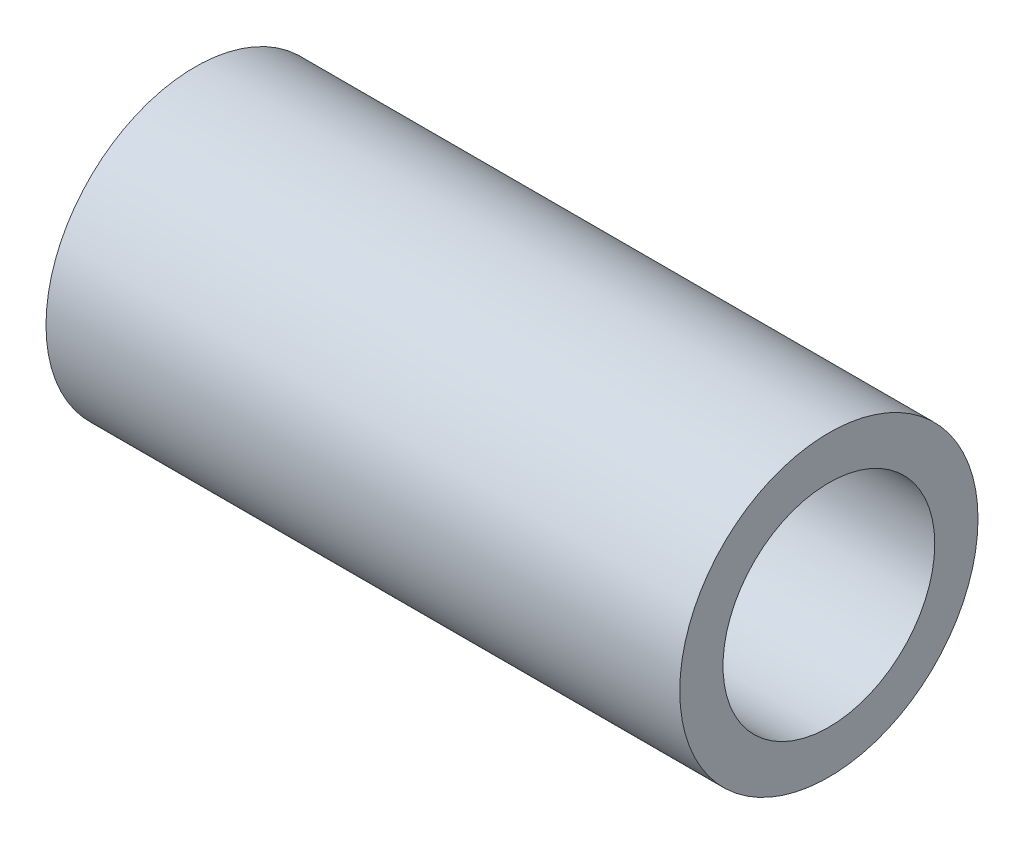
ISO-10303-21;
HEADER;
FILE_DESCRIPTION(('STEP AP214'),'2;1');
FILE_NAME('part.step','',(''),(''),'','','');
FILE_SCHEMA(('AUTOMOTIVE_DESIGN { 1 0 10303 214 1 1 1 1 }'));
ENDSEC;
DATA;
#1=APPLICATION_CONTEXT('core data for automotive mechanical design processes');
#2=APPLICATION_PROTOCOL_DEFINITION('international standard','automotive_design',2000,#1);
#3=PRODUCT_CONTEXT('',#1,'mechanical');
#4=PRODUCT('Part','Part','',(#3));
#5=PRODUCT_RELATED_PRODUCT_CATEGORY('part','',(#4));
#6=PRODUCT_DEFINITION_FORMATION('','',#4);
#7=PRODUCT_DEFINITION_CONTEXT('part definition',#1,'design');
#8=PRODUCT_DEFINITION('design','',#6,#7);
#9=PRODUCT_DEFINITION_SHAPE('','',#8);
#10=(LENGTH_UNIT() NAMED_UNIT(*) SI_UNIT(.MILLI.,.METRE.));
#11=(NAMED_UNIT(*) PLANE_ANGLE_UNIT() SI_UNIT($,.RADIAN.));
#12=(NAMED_UNIT(*) SI_UNIT($,.STERADIAN.) SOLID_ANGLE_UNIT());
#13=UNCERTAINTY_MEASURE_WITH_UNIT(LENGTH_MEASURE(1.E-05),#10,'distance_accuracy_value','');
#14=(GEOMETRIC_REPRESENTATION_CONTEXT(3) GLOBAL_UNCERTAINTY_ASSIGNED_CONTEXT((#13)) GLOBAL_UNIT_ASSIGNED_CONTEXT((#10,
#11,#12)) REPRESENTATION_CONTEXT('',''));
#15=CARTESIAN_POINT('',(0.,0.,0.));
#16=DIRECTION('',(0.,0.,1.));
#17=DIRECTION('',(1.,0.,0.));
#18=AXIS2_PLACEMENT_3D('',#15,#16,#17);
#19=CARTESIAN_POINT('',(0.,0.,0.));
#20=DIRECTION('',(1.,0.,0.));
#21=DIRECTION('',(0.,0.,-1.));
#22=AXIS2_PLACEMENT_3D('',#19,#20,#21);
#23=PLANE('',#22);
#24=CARTESIAN_POINT('',(0.,0.,0.));
#25=DIRECTION('',(1.,0.,0.));
#26=DIRECTION('',(0.,0.,-1.));
#27=AXIS2_PLACEMENT_3D('',#24,#25,#26);
#28=CIRCLE('',#27,12.7);
#29=CARTESIAN_POINT('',(0.,0.,-12.7));
#30=VERTEX_POINT('',#29);
#31=EDGE_CURVE('E11',#30,#30,#28,.T.);
#32=ORIENTED_EDGE('',*,*,#31,.F.);
#33=EDGE_LOOP('',(#32));
#34=FACE_BOUND('',#33,.T.);
#35=CARTESIAN_POINT('',(0.,0.,0.));
#36=DIRECTION('',(1.,0.,0.));
#37=DIRECTION('',(0.,0.,-1.));
#38=AXIS2_PLACEMENT_3D('',#35,#36,#37);
#39=CIRCLE('',#38,11.2141);
#40=CARTESIAN_POINT('',(0.,0.,-11.2141));
#41=VERTEX_POINT('',#40);
#42=EDGE_CURVE('E45',#41,#41,#39,.T.);
#43=ORIENTED_EDGE('',*,*,#42,.T.);
#44=EDGE_LOOP('',(#43));
#45=FACE_BOUND('',#44,.T.);
#46=ADVANCED_FACE('F38',(#34,#45),#23,.F.);
#47=CARTESIAN_POINT('',(28.575,0.,0.));
#48=DIRECTION('',(-1.,0.,0.));
#49=DIRECTION('',(0.,0.,1.));
#50=AXIS2_PLACEMENT_3D('',#47,#48,#49);
#51=CYLINDRICAL_SURFACE('',#50,12.7);
#52=ORIENTED_EDGE('',*,*,#31,.T.);
#53=EDGE_LOOP('',(#52));
#54=FACE_BOUND('',#53,.T.);
#55=CARTESIAN_POINT('',(53.975,0.,0.));
#56=DIRECTION('',(1.,0.,0.));
#57=DIRECTION('',(0.,0.,-1.));
#58=AXIS2_PLACEMENT_3D('',#55,#56,#57);
#59=CIRCLE('',#58,12.7);
#60=CARTESIAN_POINT('',(53.975,0.,-12.7));
#61=VERTEX_POINT('',#60);
#62=EDGE_CURVE('E49',#61,#61,#59,.T.);
#63=ORIENTED_EDGE('',*,*,#62,.F.);
#64=EDGE_LOOP('',(#63));
#65=FACE_BOUND('',#64,.T.);
#66=ADVANCED_FACE('F40',(#54,#65),#51,.T.);
#67=CARTESIAN_POINT('',(28.575,0.,0.));
#68=DIRECTION('',(-1.,0.,0.));
#69=DIRECTION('',(0.,0.,1.));
#70=AXIS2_PLACEMENT_3D('',#67,#68,#69);
#71=CYLINDRICAL_SURFACE('',#70,11.2141);
#72=ORIENTED_EDGE('',*,*,#42,.F.);
#73=EDGE_LOOP('',(#72));
#74=FACE_BOUND('',#73,.T.);
#75=CARTESIAN_POINT('',(31.75,0.,0.));
#76=DIRECTION('',(1.,0.,0.));
#77=DIRECTION('',(0.,0.,-1.));
#78=AXIS2_PLACEMENT_3D('',#75,#76,#77);
#79=CIRCLE('',#78,11.2141);
#80=CARTESIAN_POINT('',(31.75,0.,-11.2141));
#81=VERTEX_POINT('',#80);
#82=EDGE_CURVE('E61',#81,#81,#79,.F.);
#83=ORIENTED_EDGE('',*,*,#82,.F.);
#84=EDGE_LOOP('',(#83));
#85=FACE_BOUND('',#84,.T.);
#86=ADVANCED_FACE('F68',(#74,#85),#71,.F.);
#87=CARTESIAN_POINT('',(53.975,0.,0.));
#88=DIRECTION('',(1.,0.,0.));
#89=DIRECTION('',(0.,0.,-1.));
#90=AXIS2_PLACEMENT_3D('',#87,#88,#89);
#91=PLANE('',#90);
#92=ORIENTED_EDGE('',*,*,#62,.T.);
#93=EDGE_LOOP('',(#92));
#94=FACE_BOUND('',#93,.T.);
#95=CARTESIAN_POINT('',(53.975,0.,0.));
#96=DIRECTION('',(1.,0.,0.));
#97=DIRECTION('',(0.,0.,-1.));
#98=AXIS2_PLACEMENT_3D('',#95,#96,#97);
#99=CIRCLE('',#98,9.017);
#100=CARTESIAN_POINT('',(53.975,0.,-9.017));
#101=VERTEX_POINT('',#100);
#102=EDGE_CURVE('E53',#101,#101,#99,.T.);
#103=ORIENTED_EDGE('',*,*,#102,.F.);
#104=EDGE_LOOP('',(#103));
#105=FACE_BOUND('',#104,.T.);
#106=ADVANCED_FACE('F70',(#94,#105),#91,.T.);
#107=CARTESIAN_POINT('',(53.975,0.,0.));
#108=DIRECTION('',(-1.,0.,0.));
#109=DIRECTION('',(0.,0.,1.));
#110=AXIS2_PLACEMENT_3D('',#107,#108,#109);
#111=CYLINDRICAL_SURFACE('',#110,9.017);
#112=CARTESIAN_POINT('',(31.75,0.,0.));
#113=DIRECTION('',(1.,0.,0.));
#114=DIRECTION('',(0.,0.,-1.));
#115=AXIS2_PLACEMENT_3D('',#112,#113,#114);
#116=CIRCLE('',#115,9.017);
#117=CARTESIAN_POINT('',(31.75,0.,-9.017));
#118=VERTEX_POINT('',#117);
#119=EDGE_CURVE('E58',#118,#118,#116,.F.);
#120=ORIENTED_EDGE('',*,*,#119,.T.);
#121=EDGE_LOOP('',(#120));
#122=FACE_BOUND('',#121,.T.);
#123=ORIENTED_EDGE('',*,*,#102,.T.);
#124=EDGE_LOOP('',(#123));
#125=FACE_BOUND('',#124,.T.);
#126=ADVANCED_FACE('F77',(#122,#125),#111,.F.);
#127=CARTESIAN_POINT('',(31.75,0.,0.));
#128=DIRECTION('',(1.,0.,0.));
#129=DIRECTION('',(0.,0.,-1.));
#130=AXIS2_PLACEMENT_3D('',#127,#128,#129);
#131=PLANE('',#130);
#132=ORIENTED_EDGE('',*,*,#82,.T.);
#133=EDGE_LOOP('',(#132));
#134=FACE_BOUND('',#133,.T.);
#135=ORIENTED_EDGE('',*,*,#119,.F.);
#136=EDGE_LOOP('',(#135));
#137=FACE_BOUND('',#136,.T.);
#138=ADVANCED_FACE('F65',(#134,#137),#131,.F.);
#139=CLOSED_SHELL('',(#46,#66,#86,#106,#126,#138));
#140=MANIFOLD_SOLID_BREP('B2',#139);
#141=ADVANCED_BREP_SHAPE_REPRESENTATION('',(#18,#140),#14);
#142=SHAPE_DEFINITION_REPRESENTATION(#9,#141);
ENDSEC;
END-ISO-10303-21;
